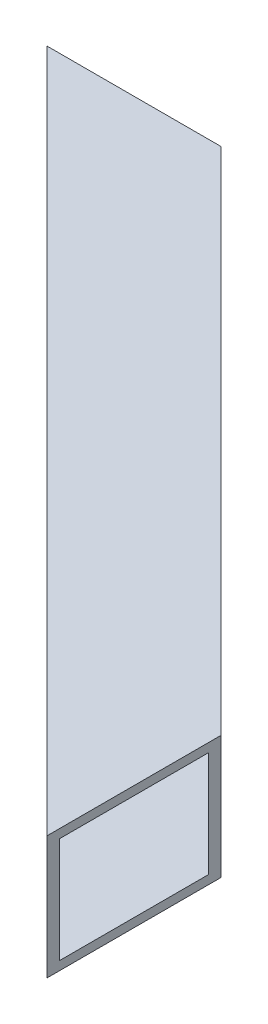
ISO-10303-21;
HEADER;
FILE_DESCRIPTION(('STEP AP214'),'2;1');
FILE_NAME('part.step','',(''),(''),'','','');
FILE_SCHEMA(('AUTOMOTIVE_DESIGN { 1 0 10303 214 1 1 1 1 }'));
ENDSEC;
DATA;
#1=APPLICATION_CONTEXT('core data for automotive mechanical design processes');
#2=APPLICATION_PROTOCOL_DEFINITION('international standard','automotive_design',2000,#1);
#3=PRODUCT_CONTEXT('',#1,'mechanical');
#4=PRODUCT('Part','Part','',(#3));
#5=PRODUCT_RELATED_PRODUCT_CATEGORY('part','',(#4));
#6=PRODUCT_DEFINITION_FORMATION('','',#4);
#7=PRODUCT_DEFINITION_CONTEXT('part definition',#1,'design');
#8=PRODUCT_DEFINITION('design','',#6,#7);
#9=PRODUCT_DEFINITION_SHAPE('','',#8);
#10=(LENGTH_UNIT() NAMED_UNIT(*) SI_UNIT(.MILLI.,.METRE.));
#11=(NAMED_UNIT(*) PLANE_ANGLE_UNIT() SI_UNIT($,.RADIAN.));
#12=(NAMED_UNIT(*) SI_UNIT($,.STERADIAN.) SOLID_ANGLE_UNIT());
#13=UNCERTAINTY_MEASURE_WITH_UNIT(LENGTH_MEASURE(1.E-05),#10,'distance_accuracy_value','');
#14=(GEOMETRIC_REPRESENTATION_CONTEXT(3) GLOBAL_UNCERTAINTY_ASSIGNED_CONTEXT((#13)) GLOBAL_UNIT_ASSIGNED_CONTEXT((#10,
#11,#12)) REPRESENTATION_CONTEXT('',''));
#15=CARTESIAN_POINT('',(0.,0.,0.));
#16=DIRECTION('',(0.,0.,1.));
#17=DIRECTION('',(1.,0.,0.));
#18=AXIS2_PLACEMENT_3D('',#15,#16,#17);
#19=CARTESIAN_POINT('',(571.515907936418,-793.75,139.661158418335));
#20=DIRECTION('',(0.707106781186547,0.,-0.707106781186548));
#21=DIRECTION('',(-0.707106781186548,0.,-0.707106781186547));
#22=AXIS2_PLACEMENT_3D('',#19,#20,#21);
#23=PLANE('',#22);
#24=DIRECTION('',(0.707106781186546,0.,0.70710678118655));
#25=VECTOR('',#24,1.);
#26=CARTESIAN_POINT('',(476.304749518083,-793.75,44.45));
#27=LINE('',#26,#25);
#28=CARTESIAN_POINT('',(476.304749518083,-793.75,44.45));
#29=VERTEX_POINT('',#28);
#30=CARTESIAN_POINT('',(660.4,-793.75,228.545250481918));
#31=VERTEX_POINT('',#30);
#32=EDGE_CURVE('E180',#29,#31,#27,.T.);
#33=ORIENTED_EDGE('',*,*,#32,.T.);
#34=DIRECTION('',(0.,1.,0.));
#35=VECTOR('',#34,1.);
#36=CARTESIAN_POINT('',(660.4,-793.75,228.545250481918));
#37=LINE('',#36,#35);
#38=CARTESIAN_POINT('',(660.4,-838.2,228.545250481918));
#39=VERTEX_POINT('',#38);
#40=EDGE_CURVE('E134',#31,#39,#37,.F.);
#41=ORIENTED_EDGE('',*,*,#40,.T.);
#42=DIRECTION('',(0.707106781186546,0.,0.70710678118655));
#43=VECTOR('',#42,1.);
#44=CARTESIAN_POINT('',(476.304749518083,-838.2,44.45));
#45=LINE('',#44,#43);
#46=CARTESIAN_POINT('',(476.304749518083,-838.2,44.45));
#47=VERTEX_POINT('',#46);
#48=EDGE_CURVE('E138',#47,#39,#45,.T.);
#49=ORIENTED_EDGE('',*,*,#48,.F.);
#50=DIRECTION('',(0.,1.,0.));
#51=VECTOR('',#50,1.);
#52=CARTESIAN_POINT('',(476.304749518083,-793.75,44.45));
#53=LINE('',#52,#51);
#54=EDGE_CURVE('E165',#29,#47,#53,.F.);
#55=ORIENTED_EDGE('',*,*,#54,.F.);
#56=EDGE_LOOP('',(#33,#41,#49,#55));
#57=FACE_BOUND('',#56,.T.);
#58=ADVANCED_FACE('F16',(#57),#23,.T.);
#59=CARTESIAN_POINT('',(544.180045378248,-793.75,170.696960647115));
#60=DIRECTION('',(-0.707106781186547,0.,0.707106781186548));
#61=DIRECTION('',(0.707106781186548,0.,0.707106781186547));
#62=AXIS2_PLACEMENT_3D('',#59,#60,#61);
#63=PLANE('',#62);
#64=DIRECTION('',(0.,1.,0.));
#65=VECTOR('',#64,1.);
#66=CARTESIAN_POINT('',(417.933084731133,-793.75,44.45));
#67=LINE('',#66,#65);
#68=CARTESIAN_POINT('',(417.933084731133,-796.925,44.4500000000001));
#69=VERTEX_POINT('',#68);
#70=CARTESIAN_POINT('',(417.933084731133,-835.025,44.4500000000001));
#71=VERTEX_POINT('',#70);
#72=EDGE_CURVE('E154',#69,#71,#67,.F.);
#73=ORIENTED_EDGE('',*,*,#72,.F.);
#74=DIRECTION('',(-0.707106781186548,0.,-0.707106781186547));
#75=VECTOR('',#74,1.);
#76=CARTESIAN_POINT('',(660.4,-796.925,286.916915268867));
#77=LINE('',#76,#75);
#78=CARTESIAN_POINT('',(660.4,-796.925,286.916915268867));
#79=VERTEX_POINT('',#78);
#80=EDGE_CURVE('E118',#79,#69,#77,.T.);
#81=ORIENTED_EDGE('',*,*,#80,.F.);
#82=DIRECTION('',(0.,1.,0.));
#83=VECTOR('',#82,1.);
#84=CARTESIAN_POINT('',(660.4,-793.75,286.916915268867));
#85=LINE('',#84,#83);
#86=CARTESIAN_POINT('',(660.4,-835.025,286.916915268867));
#87=VERTEX_POINT('',#86);
#88=EDGE_CURVE('E122',#79,#87,#85,.F.);
#89=ORIENTED_EDGE('',*,*,#88,.T.);
#90=DIRECTION('',(-0.707106781186548,0.,-0.707106781186547));
#91=VECTOR('',#90,1.);
#92=CARTESIAN_POINT('',(660.4,-835.025,286.916915268867));
#93=LINE('',#92,#91);
#94=EDGE_CURVE('E19',#87,#71,#93,.T.);
#95=ORIENTED_EDGE('',*,*,#94,.T.);
#96=EDGE_LOOP('',(#73,#81,#89,#95));
#97=FACE_BOUND('',#96,.T.);
#98=ADVANCED_FACE('F152',(#97),#63,.F.);
#99=CARTESIAN_POINT('',(484.1875,-835.025,247.65));
#100=DIRECTION('',(0.,-1.,0.));
#101=DIRECTION('',(0.,0.,-1.));
#102=AXIS2_PLACEMENT_3D('',#99,#100,#101);
#103=PLANE('',#102);
#104=ORIENTED_EDGE('',*,*,#94,.F.);
#105=DIRECTION('',(0.,0.,1.));
#106=VECTOR('',#105,1.);
#107=CARTESIAN_POINT('',(660.4,-835.025,450.85));
#108=LINE('',#107,#106);
#109=CARTESIAN_POINT('',(660.4,-835.025,233.035378542452));
#110=VERTEX_POINT('',#109);
#111=EDGE_CURVE('E128',#87,#110,#108,.F.);
#112=ORIENTED_EDGE('',*,*,#111,.T.);
#113=DIRECTION('',(-0.707106781186548,0.,-0.707106781186547));
#114=VECTOR('',#113,1.);
#115=CARTESIAN_POINT('',(569.270843906151,-835.025,141.906222448602));
#116=LINE('',#115,#114);
#117=CARTESIAN_POINT('',(471.814621457548,-835.025,44.4499999999999));
#118=VERTEX_POINT('',#117);
#119=EDGE_CURVE('E100',#110,#118,#116,.T.);
#120=ORIENTED_EDGE('',*,*,#119,.T.);
#121=DIRECTION('',(-1.,0.,0.));
#122=VECTOR('',#121,1.);
#123=CARTESIAN_POINT('',(430.640205740928,-835.025,44.45));
#124=LINE('',#123,#122);
#125=EDGE_CURVE('E156',#71,#118,#124,.F.);
#126=ORIENTED_EDGE('',*,*,#125,.F.);
#127=EDGE_LOOP('',(#104,#112,#120,#126));
#128=FACE_BOUND('',#127,.T.);
#129=ADVANCED_FACE('F157',(#128),#103,.F.);
#130=CARTESIAN_POINT('',(569.270843906151,-793.75,141.906222448602));
#131=DIRECTION('',(0.707106781186547,0.,-0.707106781186548));
#132=DIRECTION('',(-0.707106781186548,0.,-0.707106781186547));
#133=AXIS2_PLACEMENT_3D('',#130,#131,#132);
#134=PLANE('',#133);
#135=DIRECTION('',(0.,1.,0.));
#136=VECTOR('',#135,1.);
#137=CARTESIAN_POINT('',(660.4,-793.75,233.035378542452));
#138=LINE('',#137,#136);
#139=CARTESIAN_POINT('',(660.4,-796.925,233.035378542452));
#140=VERTEX_POINT('',#139);
#141=EDGE_CURVE('E94',#110,#140,#138,.T.);
#142=ORIENTED_EDGE('',*,*,#141,.T.);
#143=DIRECTION('',(0.707106781186548,0.,0.707106781186547));
#144=VECTOR('',#143,1.);
#145=CARTESIAN_POINT('',(471.814621457548,-796.925,44.45));
#146=LINE('',#145,#144);
#147=CARTESIAN_POINT('',(471.814621457548,-796.925,44.4499999999998));
#148=VERTEX_POINT('',#147);
#149=EDGE_CURVE('E98',#148,#140,#146,.T.);
#150=ORIENTED_EDGE('',*,*,#149,.F.);
#151=DIRECTION('',(0.,1.,0.));
#152=VECTOR('',#151,1.);
#153=CARTESIAN_POINT('',(471.814621457548,-793.75,44.45));
#154=LINE('',#153,#152);
#155=EDGE_CURVE('E160',#118,#148,#154,.T.);
#156=ORIENTED_EDGE('',*,*,#155,.F.);
#157=ORIENTED_EDGE('',*,*,#119,.F.);
#158=EDGE_LOOP('',(#142,#150,#156,#157));
#159=FACE_BOUND('',#158,.T.);
#160=ADVANCED_FACE('F96',(#159),#134,.F.);
#161=CARTESIAN_POINT('',(484.1875,-796.925,247.65));
#162=DIRECTION('',(0.,-1.,0.));
#163=DIRECTION('',(0.,0.,-1.));
#164=AXIS2_PLACEMENT_3D('',#161,#162,#163);
#165=PLANE('',#164);
#166=DIRECTION('',(0.,0.,1.));
#167=VECTOR('',#166,1.);
#168=CARTESIAN_POINT('',(660.4,-796.925,450.85));
#169=LINE('',#168,#167);
#170=EDGE_CURVE('E106',#140,#79,#169,.T.);
#171=ORIENTED_EDGE('',*,*,#170,.T.);
#172=ORIENTED_EDGE('',*,*,#80,.T.);
#173=DIRECTION('',(-1.,0.,0.));
#174=VECTOR('',#173,1.);
#175=CARTESIAN_POINT('',(430.640205740928,-796.925,44.45));
#176=LINE('',#175,#174);
#177=EDGE_CURVE('E115',#148,#69,#176,.T.);
#178=ORIENTED_EDGE('',*,*,#177,.F.);
#179=ORIENTED_EDGE('',*,*,#149,.T.);
#180=EDGE_LOOP('',(#171,#172,#178,#179));
#181=FACE_BOUND('',#180,.T.);
#182=ADVANCED_FACE('F111',(#181),#165,.T.);
#183=CARTESIAN_POINT('',(484.1875,-838.2,247.65));
#184=DIRECTION('',(0.,-1.,0.));
#185=DIRECTION('',(0.,0.,-1.));
#186=AXIS2_PLACEMENT_3D('',#183,#184,#185);
#187=PLANE('',#186);
#188=DIRECTION('',(0.,0.,1.));
#189=VECTOR('',#188,1.);
#190=CARTESIAN_POINT('',(660.4,-838.2,450.85));
#191=LINE('',#190,#189);
#192=CARTESIAN_POINT('',(660.4,-838.2,291.407043329402));
#193=VERTEX_POINT('',#192);
#194=EDGE_CURVE('E107',#39,#193,#191,.T.);
#195=ORIENTED_EDGE('',*,*,#194,.T.);
#196=DIRECTION('',(0.707106781186548,0.,0.707106781186547));
#197=VECTOR('',#196,1.);
#198=CARTESIAN_POINT('',(541.934981347981,-838.2,172.942024677382));
#199=LINE('',#198,#197);
#200=CARTESIAN_POINT('',(413.442956670598,-838.2,44.4499999999999));
#201=VERTEX_POINT('',#200);
#202=EDGE_CURVE('E200',#201,#193,#199,.T.);
#203=ORIENTED_EDGE('',*,*,#202,.F.);
#204=DIRECTION('',(-1.,0.,0.));
#205=VECTOR('',#204,1.);
#206=CARTESIAN_POINT('',(430.640205740928,-838.2,44.45));
#207=LINE('',#206,#205);
#208=EDGE_CURVE('E174',#47,#201,#207,.T.);
#209=ORIENTED_EDGE('',*,*,#208,.F.);
#210=ORIENTED_EDGE('',*,*,#48,.T.);
#211=EDGE_LOOP('',(#195,#203,#209,#210));
#212=FACE_BOUND('',#211,.T.);
#213=ADVANCED_FACE('F207',(#212),#187,.T.);
#214=CARTESIAN_POINT('',(660.4,-793.75,450.85));
#215=DIRECTION('',(-1.,0.,0.));
#216=DIRECTION('',(0.,0.,1.));
#217=AXIS2_PLACEMENT_3D('',#214,#215,#216);
#218=PLANE('',#217);
#219=ORIENTED_EDGE('',*,*,#88,.F.);
#220=ORIENTED_EDGE('',*,*,#170,.F.);
#221=ORIENTED_EDGE('',*,*,#141,.F.);
#222=ORIENTED_EDGE('',*,*,#111,.F.);
#223=EDGE_LOOP('',(#219,#220,#221,#222));
#224=FACE_BOUND('',#223,.T.);
#225=ORIENTED_EDGE('',*,*,#40,.F.);
#226=DIRECTION('',(0.,0.,-1.));
#227=VECTOR('',#226,1.);
#228=CARTESIAN_POINT('',(660.4,-793.75,247.65));
#229=LINE('',#228,#227);
#230=CARTESIAN_POINT('',(660.4,-793.75,291.407043329402));
#231=VERTEX_POINT('',#230);
#232=EDGE_CURVE('E178',#31,#231,#229,.F.);
#233=ORIENTED_EDGE('',*,*,#232,.T.);
#234=DIRECTION('',(0.,1.,0.));
#235=VECTOR('',#234,1.);
#236=CARTESIAN_POINT('',(660.400000000001,-793.75,291.407043329401));
#237=LINE('',#236,#235);
#238=EDGE_CURVE('E196',#193,#231,#237,.T.);
#239=ORIENTED_EDGE('',*,*,#238,.F.);
#240=ORIENTED_EDGE('',*,*,#194,.F.);
#241=EDGE_LOOP('',(#225,#233,#239,#240));
#242=FACE_BOUND('',#241,.T.);
#243=ADVANCED_FACE('F120',(#224,#242),#218,.F.);
#244=CARTESIAN_POINT('',(484.1875,-793.75,247.65));
#245=DIRECTION('',(0.,-1.,0.));
#246=DIRECTION('',(0.,0.,-1.));
#247=AXIS2_PLACEMENT_3D('',#244,#245,#246);
#248=PLANE('',#247);
#249=DIRECTION('',(0.707106781186548,0.,0.707106781186547));
#250=VECTOR('',#249,1.);
#251=CARTESIAN_POINT('',(541.934981347981,-793.75,172.942024677382));
#252=LINE('',#251,#250);
#253=CARTESIAN_POINT('',(413.442956670598,-793.75,44.4499999999999));
#254=VERTEX_POINT('',#253);
#255=EDGE_CURVE('E26',#231,#254,#252,.F.);
#256=ORIENTED_EDGE('',*,*,#255,.F.);
#257=ORIENTED_EDGE('',*,*,#232,.F.);
#258=ORIENTED_EDGE('',*,*,#32,.F.);
#259=DIRECTION('',(-1.,0.,0.));
#260=VECTOR('',#259,1.);
#261=CARTESIAN_POINT('',(430.640205740928,-793.75,44.45));
#262=LINE('',#261,#260);
#263=EDGE_CURVE('E39',#254,#29,#262,.F.);
#264=ORIENTED_EDGE('',*,*,#263,.F.);
#265=EDGE_LOOP('',(#256,#257,#258,#264));
#266=FACE_BOUND('',#265,.T.);
#267=ADVANCED_FACE('F191',(#266),#248,.F.);
#268=CARTESIAN_POINT('',(430.640205740928,-793.75,44.45));
#269=DIRECTION('',(0.,0.,-1.));
#270=DIRECTION('',(-1.,0.,0.));
#271=AXIS2_PLACEMENT_3D('',#268,#269,#270);
#272=PLANE('',#271);
#273=ORIENTED_EDGE('',*,*,#155,.T.);
#274=ORIENTED_EDGE('',*,*,#177,.T.);
#275=ORIENTED_EDGE('',*,*,#72,.T.);
#276=ORIENTED_EDGE('',*,*,#125,.T.);
#277=EDGE_LOOP('',(#273,#274,#275,#276));
#278=FACE_BOUND('',#277,.T.);
#279=ORIENTED_EDGE('',*,*,#263,.T.);
#280=ORIENTED_EDGE('',*,*,#54,.T.);
#281=ORIENTED_EDGE('',*,*,#208,.T.);
#282=DIRECTION('',(0.,1.,0.));
#283=VECTOR('',#282,1.);
#284=CARTESIAN_POINT('',(413.442956670598,-793.75,44.4499999999996));
#285=LINE('',#284,#283);
#286=EDGE_CURVE('E11',#254,#201,#285,.F.);
#287=ORIENTED_EDGE('',*,*,#286,.F.);
#288=EDGE_LOOP('',(#279,#280,#281,#287));
#289=FACE_BOUND('',#288,.T.);
#290=ADVANCED_FACE('F162',(#278,#289),#272,.T.);
#291=CARTESIAN_POINT('',(541.934981347981,-793.75,172.942024677382));
#292=DIRECTION('',(-0.707106781186547,0.,0.707106781186548));
#293=DIRECTION('',(0.707106781186548,0.,0.707106781186547));
#294=AXIS2_PLACEMENT_3D('',#291,#292,#293);
#295=PLANE('',#294);
#296=ORIENTED_EDGE('',*,*,#255,.T.);
#297=ORIENTED_EDGE('',*,*,#286,.T.);
#298=ORIENTED_EDGE('',*,*,#202,.T.);
#299=ORIENTED_EDGE('',*,*,#238,.T.);
#300=EDGE_LOOP('',(#296,#297,#298,#299));
#301=FACE_BOUND('',#300,.T.);
#302=ADVANCED_FACE('F199',(#301),#295,.T.);
#303=CLOSED_SHELL('',(#58,#98,#129,#160,#182,#213,#243,#267,#290,#302));
#304=MANIFOLD_SOLID_BREP('B1',#303);
#305=ADVANCED_BREP_SHAPE_REPRESENTATION('',(#18,#304),#14);
#306=SHAPE_DEFINITION_REPRESENTATION(#9,#305);
ENDSEC;
END-ISO-10303-21;
